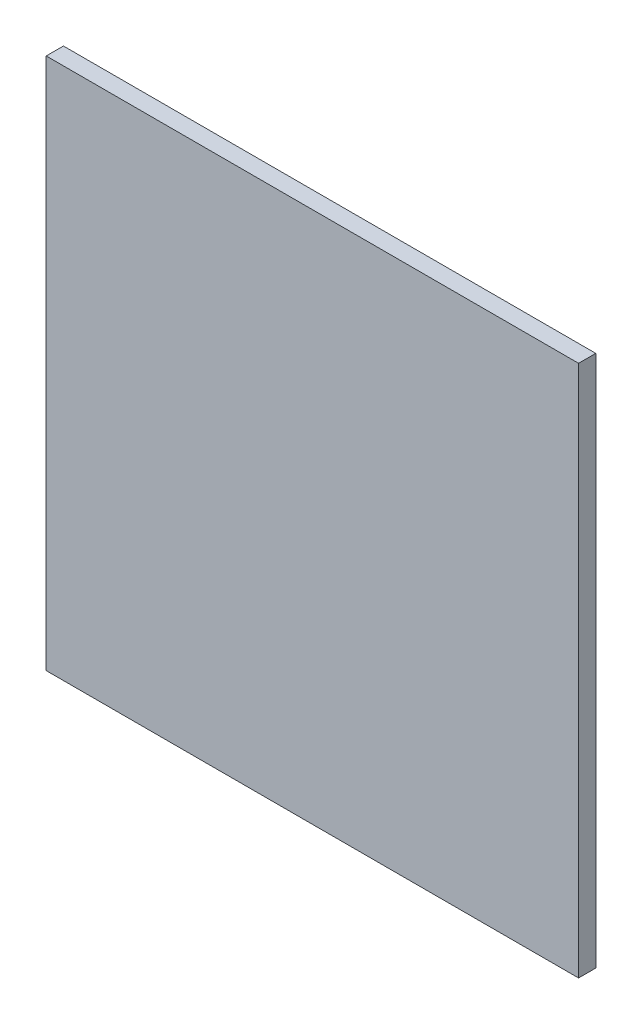
ISO-10303-21;
HEADER;
FILE_DESCRIPTION(('STEP AP214'),'2;1');
FILE_NAME('part.step','',(''),(''),'','','');
FILE_SCHEMA(('AUTOMOTIVE_DESIGN { 1 0 10303 214 1 1 1 1 }'));
ENDSEC;
DATA;
#1=APPLICATION_CONTEXT('core data for automotive mechanical design processes');
#2=APPLICATION_PROTOCOL_DEFINITION('international standard','automotive_design',2000,#1);
#3=PRODUCT_CONTEXT('',#1,'mechanical');
#4=PRODUCT('Part','Part','',(#3));
#5=PRODUCT_RELATED_PRODUCT_CATEGORY('part','',(#4));
#6=PRODUCT_DEFINITION_FORMATION('','',#4);
#7=PRODUCT_DEFINITION_CONTEXT('part definition',#1,'design');
#8=PRODUCT_DEFINITION('design','',#6,#7);
#9=PRODUCT_DEFINITION_SHAPE('','',#8);
#10=(LENGTH_UNIT() NAMED_UNIT(*) SI_UNIT(.MILLI.,.METRE.));
#11=(NAMED_UNIT(*) PLANE_ANGLE_UNIT() SI_UNIT($,.RADIAN.));
#12=(NAMED_UNIT(*) SI_UNIT($,.STERADIAN.) SOLID_ANGLE_UNIT());
#13=UNCERTAINTY_MEASURE_WITH_UNIT(LENGTH_MEASURE(1.E-05),#10,'distance_accuracy_value','');
#14=(GEOMETRIC_REPRESENTATION_CONTEXT(3) GLOBAL_UNCERTAINTY_ASSIGNED_CONTEXT((#13)) GLOBAL_UNIT_ASSIGNED_CONTEXT((#10,
#11,#12)) REPRESENTATION_CONTEXT('',''));
#15=CARTESIAN_POINT('',(0.,0.,0.));
#16=DIRECTION('',(0.,0.,1.));
#17=DIRECTION('',(1.,0.,0.));
#18=AXIS2_PLACEMENT_3D('',#15,#16,#17);
#19=CARTESIAN_POINT('',(0.,0.,11.90625));
#20=DIRECTION('',(1.,0.,0.));
#21=DIRECTION('',(0.,0.,-1.));
#22=AXIS2_PLACEMENT_3D('',#19,#20,#21);
#23=PLANE('',#22);
#24=DIRECTION('',(0.,-1.,0.));
#25=VECTOR('',#24,1.);
#26=CARTESIAN_POINT('',(0.,0.,0.));
#27=LINE('',#26,#25);
#28=CARTESIAN_POINT('',(0.,368.3,0.));
#29=VERTEX_POINT('',#28);
#30=CARTESIAN_POINT('',(0.,0.,0.));
#31=VERTEX_POINT('',#30);
#32=EDGE_CURVE('E95',#29,#31,#27,.T.);
#33=ORIENTED_EDGE('',*,*,#32,.T.);
#34=DIRECTION('',(0.,0.,-1.));
#35=VECTOR('',#34,1.);
#36=CARTESIAN_POINT('',(0.,0.,11.90625));
#37=LINE('',#36,#35);
#38=CARTESIAN_POINT('',(0.,0.,11.90625));
#39=VERTEX_POINT('',#38);
#40=EDGE_CURVE('E11',#39,#31,#37,.T.);
#41=ORIENTED_EDGE('',*,*,#40,.F.);
#42=DIRECTION('',(0.,-1.,0.));
#43=VECTOR('',#42,1.);
#44=CARTESIAN_POINT('',(0.,0.,11.90625));
#45=LINE('',#44,#43);
#46=CARTESIAN_POINT('',(0.,368.3,11.90625));
#47=VERTEX_POINT('',#46);
#48=EDGE_CURVE('E83',#47,#39,#45,.T.);
#49=ORIENTED_EDGE('',*,*,#48,.F.);
#50=DIRECTION('',(0.,0.,-1.));
#51=VECTOR('',#50,1.);
#52=CARTESIAN_POINT('',(0.,368.3,11.90625));
#53=LINE('',#52,#51);
#54=EDGE_CURVE('E91',#47,#29,#53,.T.);
#55=ORIENTED_EDGE('',*,*,#54,.T.);
#56=EDGE_LOOP('',(#33,#41,#49,#55));
#57=FACE_BOUND('',#56,.T.);
#58=ADVANCED_FACE('F32',(#57),#23,.F.);
#59=CARTESIAN_POINT('',(0.,0.,11.90625));
#60=DIRECTION('',(0.,1.,0.));
#61=DIRECTION('',(0.,0.,1.));
#62=AXIS2_PLACEMENT_3D('',#59,#60,#61);
#63=PLANE('',#62);
#64=DIRECTION('',(1.,0.,0.));
#65=VECTOR('',#64,1.);
#66=CARTESIAN_POINT('',(0.,0.,0.));
#67=LINE('',#66,#65);
#68=CARTESIAN_POINT('',(368.3,0.,0.));
#69=VERTEX_POINT('',#68);
#70=EDGE_CURVE('E87',#31,#69,#67,.T.);
#71=ORIENTED_EDGE('',*,*,#70,.T.);
#72=DIRECTION('',(0.,0.,-1.));
#73=VECTOR('',#72,1.);
#74=CARTESIAN_POINT('',(368.3,0.,11.90625));
#75=LINE('',#74,#73);
#76=CARTESIAN_POINT('',(368.3,0.,11.90625));
#77=VERTEX_POINT('',#76);
#78=EDGE_CURVE('E40',#77,#69,#75,.T.);
#79=ORIENTED_EDGE('',*,*,#78,.F.);
#80=DIRECTION('',(1.,0.,0.));
#81=VECTOR('',#80,1.);
#82=CARTESIAN_POINT('',(0.,0.,11.90625));
#83=LINE('',#82,#81);
#84=EDGE_CURVE('E78',#39,#77,#83,.T.);
#85=ORIENTED_EDGE('',*,*,#84,.F.);
#86=ORIENTED_EDGE('',*,*,#40,.T.);
#87=EDGE_LOOP('',(#71,#79,#85,#86));
#88=FACE_BOUND('',#87,.T.);
#89=ADVANCED_FACE('F86',(#88),#63,.F.);
#90=CARTESIAN_POINT('',(368.3,0.,11.90625));
#91=DIRECTION('',(-1.,0.,0.));
#92=DIRECTION('',(0.,0.,1.));
#93=AXIS2_PLACEMENT_3D('',#90,#91,#92);
#94=PLANE('',#93);
#95=DIRECTION('',(0.,1.,0.));
#96=VECTOR('',#95,1.);
#97=CARTESIAN_POINT('',(368.3,0.,0.));
#98=LINE('',#97,#96);
#99=CARTESIAN_POINT('',(368.3,368.3,0.));
#100=VERTEX_POINT('',#99);
#101=EDGE_CURVE('E65',#69,#100,#98,.T.);
#102=ORIENTED_EDGE('',*,*,#101,.T.);
#103=DIRECTION('',(0.,0.,-1.));
#104=VECTOR('',#103,1.);
#105=CARTESIAN_POINT('',(368.3,368.3,11.90625));
#106=LINE('',#105,#104);
#107=CARTESIAN_POINT('',(368.3,368.3,11.90625));
#108=VERTEX_POINT('',#107);
#109=EDGE_CURVE('E88',#108,#100,#106,.T.);
#110=ORIENTED_EDGE('',*,*,#109,.F.);
#111=DIRECTION('',(0.,1.,0.));
#112=VECTOR('',#111,1.);
#113=CARTESIAN_POINT('',(368.3,0.,11.90625));
#114=LINE('',#113,#112);
#115=EDGE_CURVE('E81',#77,#108,#114,.T.);
#116=ORIENTED_EDGE('',*,*,#115,.F.);
#117=ORIENTED_EDGE('',*,*,#78,.T.);
#118=EDGE_LOOP('',(#102,#110,#116,#117));
#119=FACE_BOUND('',#118,.T.);
#120=ADVANCED_FACE('F89',(#119),#94,.F.);
#121=CARTESIAN_POINT('',(0.,368.3,11.90625));
#122=DIRECTION('',(0.,-1.,0.));
#123=DIRECTION('',(0.,0.,-1.));
#124=AXIS2_PLACEMENT_3D('',#121,#122,#123);
#125=PLANE('',#124);
#126=DIRECTION('',(-1.,0.,0.));
#127=VECTOR('',#126,1.);
#128=CARTESIAN_POINT('',(0.,368.3,0.));
#129=LINE('',#128,#127);
#130=EDGE_CURVE('E71',#100,#29,#129,.T.);
#131=ORIENTED_EDGE('',*,*,#130,.T.);
#132=ORIENTED_EDGE('',*,*,#54,.F.);
#133=DIRECTION('',(-1.,0.,0.));
#134=VECTOR('',#133,1.);
#135=CARTESIAN_POINT('',(0.,368.3,11.90625));
#136=LINE('',#135,#134);
#137=EDGE_CURVE('E48',#108,#47,#136,.T.);
#138=ORIENTED_EDGE('',*,*,#137,.F.);
#139=ORIENTED_EDGE('',*,*,#109,.T.);
#140=EDGE_LOOP('',(#131,#132,#138,#139));
#141=FACE_BOUND('',#140,.T.);
#142=ADVANCED_FACE('F102',(#141),#125,.F.);
#143=CARTESIAN_POINT('',(0.,0.,11.90625));
#144=DIRECTION('',(0.,0.,-1.));
#145=DIRECTION('',(-1.,0.,0.));
#146=AXIS2_PLACEMENT_3D('',#143,#144,#145);
#147=PLANE('',#146);
#148=ORIENTED_EDGE('',*,*,#48,.T.);
#149=ORIENTED_EDGE('',*,*,#84,.T.);
#150=ORIENTED_EDGE('',*,*,#115,.T.);
#151=ORIENTED_EDGE('',*,*,#137,.T.);
#152=EDGE_LOOP('',(#148,#149,#150,#151));
#153=FACE_BOUND('',#152,.T.);
#154=ADVANCED_FACE('F79',(#153),#147,.F.);
#155=CARTESIAN_POINT('',(0.,0.,0.));
#156=DIRECTION('',(0.,0.,-1.));
#157=DIRECTION('',(-1.,0.,0.));
#158=AXIS2_PLACEMENT_3D('',#155,#156,#157);
#159=PLANE('',#158);
#160=ORIENTED_EDGE('',*,*,#32,.F.);
#161=ORIENTED_EDGE('',*,*,#130,.F.);
#162=ORIENTED_EDGE('',*,*,#101,.F.);
#163=ORIENTED_EDGE('',*,*,#70,.F.);
#164=EDGE_LOOP('',(#160,#161,#162,#163));
#165=FACE_BOUND('',#164,.T.);
#166=ADVANCED_FACE('F105',(#165),#159,.T.);
#167=CLOSED_SHELL('',(#58,#89,#120,#142,#154,#166));
#168=MANIFOLD_SOLID_BREP('B2',#167);
#169=ADVANCED_BREP_SHAPE_REPRESENTATION('',(#18,#168),#14);
#170=SHAPE_DEFINITION_REPRESENTATION(#9,#169);
ENDSEC;
END-ISO-10303-21;
